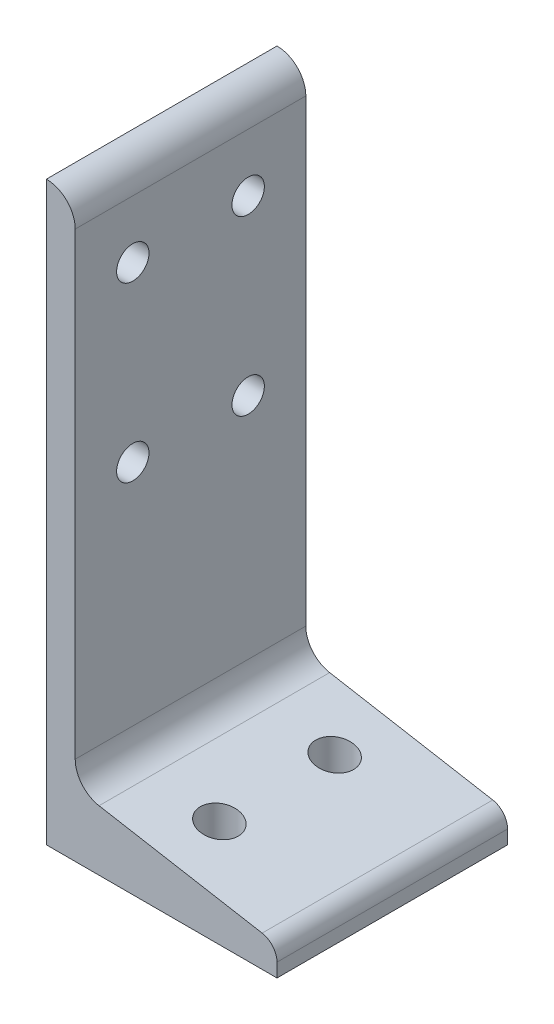
ISO-10303-21;
HEADER;
FILE_DESCRIPTION(('STEP AP214'),'2;1');
FILE_NAME('part.step','',(''),(''),'','','');
FILE_SCHEMA(('AUTOMOTIVE_DESIGN { 1 0 10303 214 1 1 1 1 }'));
ENDSEC;
DATA;
#1=APPLICATION_CONTEXT('core data for automotive mechanical design processes');
#2=APPLICATION_PROTOCOL_DEFINITION('international standard','automotive_design',2000,#1);
#3=PRODUCT_CONTEXT('',#1,'mechanical');
#4=PRODUCT('Part','Part','',(#3));
#5=PRODUCT_RELATED_PRODUCT_CATEGORY('part','',(#4));
#6=PRODUCT_DEFINITION_FORMATION('','',#4);
#7=PRODUCT_DEFINITION_CONTEXT('part definition',#1,'design');
#8=PRODUCT_DEFINITION('design','',#6,#7);
#9=PRODUCT_DEFINITION_SHAPE('','',#8);
#10=(LENGTH_UNIT() NAMED_UNIT(*) SI_UNIT(.MILLI.,.METRE.));
#11=(NAMED_UNIT(*) PLANE_ANGLE_UNIT() SI_UNIT($,.RADIAN.));
#12=(NAMED_UNIT(*) SI_UNIT($,.STERADIAN.) SOLID_ANGLE_UNIT());
#13=UNCERTAINTY_MEASURE_WITH_UNIT(LENGTH_MEASURE(1.E-05),#10,'distance_accuracy_value','');
#14=(GEOMETRIC_REPRESENTATION_CONTEXT(3) GLOBAL_UNCERTAINTY_ASSIGNED_CONTEXT((#13)) GLOBAL_UNIT_ASSIGNED_CONTEXT((#10,
#11,#12)) REPRESENTATION_CONTEXT('',''));
#15=CARTESIAN_POINT('',(0.,0.,0.));
#16=DIRECTION('',(0.,0.,1.));
#17=DIRECTION('',(1.,0.,0.));
#18=AXIS2_PLACEMENT_3D('',#15,#16,#17);
#19=CARTESIAN_POINT('',(-16.3878975119817,-59.0727168406568,-50.8));
#20=DIRECTION('',(-1.,0.,0.));
#21=DIRECTION('',(0.,-1.,0.));
#22=AXIS2_PLACEMENT_3D('',#19,#20,#21);
#23=PLANE('',#22);
#24=CARTESIAN_POINT('',(-16.3878975119818,121.648995440178,-12.6852380775335));
#25=DIRECTION('',(-1.,0.,0.));
#26=DIRECTION('',(0.,1.,0.));
#27=AXIS2_PLACEMENT_3D('',#24,#25,#26);
#28=CIRCLE('',#27,3.56870000000001);
#29=CARTESIAN_POINT('',(-16.3878975119818,125.217695440178,-12.6852380775335));
#30=VERTEX_POINT('',#29);
#31=EDGE_CURVE('E177',#30,#30,#28,.T.);
#32=ORIENTED_EDGE('',*,*,#31,.T.);
#33=EDGE_LOOP('',(#32));
#34=FACE_BOUND('',#33,.T.);
#35=CARTESIAN_POINT('',(-16.3878975119817,83.5489782815445,-12.6852380775335));
#36=DIRECTION('',(-1.,0.,0.));
#37=DIRECTION('',(0.,1.,0.));
#38=AXIS2_PLACEMENT_3D('',#35,#36,#37);
#39=CIRCLE('',#38,3.56869999999999);
#40=CARTESIAN_POINT('',(-16.3878975119817,87.1176782815445,-12.6852380775335));
#41=VERTEX_POINT('',#40);
#42=EDGE_CURVE('E193',#41,#41,#39,.T.);
#43=ORIENTED_EDGE('',*,*,#42,.T.);
#44=EDGE_LOOP('',(#43));
#45=FACE_BOUND('',#44,.T.);
#46=CARTESIAN_POINT('',(-16.3878975119817,83.5489782815445,-38.1));
#47=DIRECTION('',(-1.,0.,0.));
#48=DIRECTION('',(0.,1.,0.));
#49=AXIS2_PLACEMENT_3D('',#46,#47,#48);
#50=CIRCLE('',#49,3.56869999999999);
#51=CARTESIAN_POINT('',(-16.3878975119817,87.1176782815445,-38.1));
#52=VERTEX_POINT('',#51);
#53=EDGE_CURVE('E198',#52,#52,#50,.T.);
#54=ORIENTED_EDGE('',*,*,#53,.T.);
#55=EDGE_LOOP('',(#54));
#56=FACE_BOUND('',#55,.T.);
#57=CARTESIAN_POINT('',(-16.3878975119818,121.648978281545,-38.1));
#58=DIRECTION('',(-1.,0.,0.));
#59=DIRECTION('',(0.,1.,0.));
#60=AXIS2_PLACEMENT_3D('',#57,#58,#59);
#61=CIRCLE('',#60,3.56870000000002);
#62=CARTESIAN_POINT('',(-16.3878975119818,125.217678281545,-38.1));
#63=VERTEX_POINT('',#62);
#64=EDGE_CURVE('E204',#63,#63,#61,.T.);
#65=ORIENTED_EDGE('',*,*,#64,.T.);
#66=EDGE_LOOP('',(#65));
#67=FACE_BOUND('',#66,.T.);
#68=DIRECTION('',(0.,1.,0.));
#69=VECTOR('',#68,1.);
#70=CARTESIAN_POINT('',(-16.3878975119817,-59.0727168406568,0.));
#71=LINE('',#70,#69);
#72=CARTESIAN_POINT('',(-16.3878975119817,33.2149952320115,0.));
#73=VERTEX_POINT('',#72);
#74=CARTESIAN_POINT('',(-16.3878975119818,134.348978281545,0.));
#75=VERTEX_POINT('',#74);
#76=EDGE_CURVE('E209',#73,#75,#71,.T.);
#77=ORIENTED_EDGE('',*,*,#76,.F.);
#78=DIRECTION('',(0.,0.,1.));
#79=VECTOR('',#78,1.);
#80=CARTESIAN_POINT('',(-16.3878975119817,33.2149952320115,-50.8));
#81=LINE('',#80,#79);
#82=CARTESIAN_POINT('',(-16.3878975119817,33.2149952320115,-50.8));
#83=VERTEX_POINT('',#82);
#84=EDGE_CURVE('E276',#83,#73,#81,.T.);
#85=ORIENTED_EDGE('',*,*,#84,.F.);
#86=DIRECTION('',(0.,1.,0.));
#87=VECTOR('',#86,1.);
#88=CARTESIAN_POINT('',(-16.3878975119817,-59.0727168406568,-50.8));
#89=LINE('',#88,#87);
#90=CARTESIAN_POINT('',(-16.3878975119818,134.348978281545,-50.8));
#91=VERTEX_POINT('',#90);
#92=EDGE_CURVE('E155',#83,#91,#89,.T.);
#93=ORIENTED_EDGE('',*,*,#92,.T.);
#94=DIRECTION('',(0.,0.,1.));
#95=VECTOR('',#94,1.);
#96=CARTESIAN_POINT('',(-16.3878975119818,134.348978281545,-50.8));
#97=LINE('',#96,#95);
#98=EDGE_CURVE('E11',#91,#75,#97,.T.);
#99=ORIENTED_EDGE('',*,*,#98,.T.);
#100=EDGE_LOOP('',(#77,#85,#93,#99));
#101=FACE_BOUND('',#100,.T.);
#102=ADVANCED_FACE('F34',(#34,#45,#56,#67,#101),#23,.F.);
#103=CARTESIAN_POINT('',(-22.7378975119818,134.348978281545,-50.8));
#104=DIRECTION('',(0.,0.,1.));
#105=DIRECTION('',(-1.,0.,0.));
#106=AXIS2_PLACEMENT_3D('',#103,#104,#105);
#107=ELLIPSE('',#106,6.35,6.34999999999999);
#108=DIRECTION('',(0.,0.,1.));
#109=VECTOR('',#108,1.);
#110=SURFACE_OF_LINEAR_EXTRUSION('',#107,#109);
#111=CARTESIAN_POINT('',(-22.7378975119818,134.348978281545,0.));
#112=DIRECTION('',(0.,0.,1.));
#113=DIRECTION('',(-1.,0.,0.));
#114=AXIS2_PLACEMENT_3D('',#111,#112,#113);
#115=ELLIPSE('',#114,6.35,6.34999999999999);
#116=CARTESIAN_POINT('',(-22.7378975119817,140.698978281545,0.));
#117=VERTEX_POINT('',#116);
#118=EDGE_CURVE('E278',#75,#117,#115,.T.);
#119=ORIENTED_EDGE('',*,*,#118,.F.);
#120=ORIENTED_EDGE('',*,*,#98,.F.);
#121=CARTESIAN_POINT('',(-22.7378975119817,140.698978281545,-50.8));
#122=VERTEX_POINT('',#121);
#123=EDGE_CURVE('E90',#91,#122,#107,.T.);
#124=ORIENTED_EDGE('',*,*,#123,.T.);
#125=DIRECTION('',(0.,0.,1.));
#126=VECTOR('',#125,1.);
#127=CARTESIAN_POINT('',(-22.7378975119817,140.698978281545,-50.8));
#128=LINE('',#127,#126);
#129=EDGE_CURVE('E43',#122,#117,#128,.T.);
#130=ORIENTED_EDGE('',*,*,#129,.T.);
#131=EDGE_LOOP('',(#119,#120,#124,#130));
#132=FACE_BOUND('',#131,.T.);
#133=ADVANCED_FACE('F146',(#132),#110,.T.);
#134=CARTESIAN_POINT('',(-22.7378975119817,-59.0727168406568,-50.8));
#135=DIRECTION('',(1.,0.,0.));
#136=DIRECTION('',(0.,1.,0.));
#137=AXIS2_PLACEMENT_3D('',#134,#135,#136);
#138=PLANE('',#137);
#139=CARTESIAN_POINT('',(-22.7378975119818,121.648995440178,-12.6852380775335));
#140=DIRECTION('',(-1.,0.,0.));
#141=DIRECTION('',(0.,1.,0.));
#142=AXIS2_PLACEMENT_3D('',#139,#140,#141);
#143=CIRCLE('',#142,3.56870000000001);
#144=CARTESIAN_POINT('',(-22.7378975119818,125.217695440178,-12.6852380775335));
#145=VERTEX_POINT('',#144);
#146=EDGE_CURVE('E182',#145,#145,#143,.T.);
#147=ORIENTED_EDGE('',*,*,#146,.F.);
#148=EDGE_LOOP('',(#147));
#149=FACE_BOUND('',#148,.T.);
#150=CARTESIAN_POINT('',(-22.7378975119818,83.5489782815445,-12.6852380775335));
#151=DIRECTION('',(-1.,0.,0.));
#152=DIRECTION('',(0.,1.,0.));
#153=AXIS2_PLACEMENT_3D('',#150,#151,#152);
#154=CIRCLE('',#153,3.56869999999999);
#155=CARTESIAN_POINT('',(-22.7378975119818,87.1176782815445,-12.6852380775335));
#156=VERTEX_POINT('',#155);
#157=EDGE_CURVE('E195',#156,#156,#154,.T.);
#158=ORIENTED_EDGE('',*,*,#157,.F.);
#159=EDGE_LOOP('',(#158));
#160=FACE_BOUND('',#159,.T.);
#161=CARTESIAN_POINT('',(-22.7378975119818,83.5489782815445,-38.1));
#162=DIRECTION('',(-1.,0.,0.));
#163=DIRECTION('',(0.,1.,0.));
#164=AXIS2_PLACEMENT_3D('',#161,#162,#163);
#165=CIRCLE('',#164,3.56869999999999);
#166=CARTESIAN_POINT('',(-22.7378975119818,87.1176782815445,-38.1));
#167=VERTEX_POINT('',#166);
#168=EDGE_CURVE('E201',#167,#167,#165,.T.);
#169=ORIENTED_EDGE('',*,*,#168,.F.);
#170=EDGE_LOOP('',(#169));
#171=FACE_BOUND('',#170,.T.);
#172=CARTESIAN_POINT('',(-22.7378975119818,121.648978281545,-38.1));
#173=DIRECTION('',(-1.,0.,0.));
#174=DIRECTION('',(0.,1.,0.));
#175=AXIS2_PLACEMENT_3D('',#172,#173,#174);
#176=CIRCLE('',#175,3.56870000000002);
#177=CARTESIAN_POINT('',(-22.7378975119818,125.217678281545,-38.1));
#178=VERTEX_POINT('',#177);
#179=EDGE_CURVE('E207',#178,#178,#176,.T.);
#180=ORIENTED_EDGE('',*,*,#179,.F.);
#181=EDGE_LOOP('',(#180));
#182=FACE_BOUND('',#181,.T.);
#183=DIRECTION('',(0.,-1.,0.));
#184=VECTOR('',#183,1.);
#185=CARTESIAN_POINT('',(-22.7378975119817,-59.0727168406568,0.));
#186=LINE('',#185,#184);
#187=CARTESIAN_POINT('',(-22.7378975119817,13.6989782815445,0.));
#188=VERTEX_POINT('',#187);
#189=EDGE_CURVE('E281',#117,#188,#186,.T.);
#190=ORIENTED_EDGE('',*,*,#189,.F.);
#191=ORIENTED_EDGE('',*,*,#129,.F.);
#192=DIRECTION('',(0.,-1.,0.));
#193=VECTOR('',#192,1.);
#194=CARTESIAN_POINT('',(-22.7378975119817,-59.0727168406568,-50.8));
#195=LINE('',#194,#193);
#196=CARTESIAN_POINT('',(-22.7378975119817,13.6989782815445,-50.8));
#197=VERTEX_POINT('',#196);
#198=EDGE_CURVE('E154',#122,#197,#195,.T.);
#199=ORIENTED_EDGE('',*,*,#198,.T.);
#200=DIRECTION('',(0.,0.,1.));
#201=VECTOR('',#200,1.);
#202=CARTESIAN_POINT('',(-22.7378975119817,13.6989782815445,-50.8));
#203=LINE('',#202,#201);
#204=EDGE_CURVE('E166',#197,#188,#203,.T.);
#205=ORIENTED_EDGE('',*,*,#204,.T.);
#206=EDGE_LOOP('',(#190,#191,#199,#205));
#207=FACE_BOUND('',#206,.T.);
#208=ADVANCED_FACE('F143',(#149,#160,#171,#182,#207),#138,.F.);
#209=CARTESIAN_POINT('',(-12.9149361595296,13.6989782815445,-50.8));
#210=DIRECTION('',(0.,1.,0.));
#211=DIRECTION('',(-1.,0.,0.));
#212=AXIS2_PLACEMENT_3D('',#209,#210,#211);
#213=PLANE('',#212);
#214=CARTESIAN_POINT('',(2.66210248801829,13.6989782815445,-38.1));
#215=DIRECTION('',(0.,1.,0.));
#216=DIRECTION('',(1.,0.,0.));
#217=AXIS2_PLACEMENT_3D('',#214,#215,#216);
#218=CIRCLE('',#217,4.1656);
#219=CARTESIAN_POINT('',(6.82770248801829,13.6989782815445,-38.1));
#220=VERTEX_POINT('',#219);
#221=EDGE_CURVE('E189',#220,#220,#218,.T.);
#222=ORIENTED_EDGE('',*,*,#221,.T.);
#223=EDGE_LOOP('',(#222));
#224=FACE_BOUND('',#223,.T.);
#225=CARTESIAN_POINT('',(2.66210248801829,13.6989782815445,-12.7));
#226=DIRECTION('',(0.,1.,0.));
#227=DIRECTION('',(1.,0.,0.));
#228=AXIS2_PLACEMENT_3D('',#225,#226,#227);
#229=CIRCLE('',#228,4.1656);
#230=CARTESIAN_POINT('',(6.82770248801829,13.6989782815445,-12.7));
#231=VERTEX_POINT('',#230);
#232=EDGE_CURVE('E178',#231,#231,#229,.T.);
#233=ORIENTED_EDGE('',*,*,#232,.T.);
#234=EDGE_LOOP('',(#233));
#235=FACE_BOUND('',#234,.T.);
#236=DIRECTION('',(1.,0.,0.));
#237=VECTOR('',#236,1.);
#238=CARTESIAN_POINT('',(-12.9149361595296,13.6989782815445,0.));
#239=LINE('',#238,#237);
#240=CARTESIAN_POINT('',(28.0621024880183,13.6989782815445,0.));
#241=VERTEX_POINT('',#240);
#242=EDGE_CURVE('E284',#188,#241,#239,.T.);
#243=ORIENTED_EDGE('',*,*,#242,.F.);
#244=ORIENTED_EDGE('',*,*,#204,.F.);
#245=DIRECTION('',(1.,0.,0.));
#246=VECTOR('',#245,1.);
#247=CARTESIAN_POINT('',(-12.9149361595296,13.6989782815445,-50.8));
#248=LINE('',#247,#246);
#249=CARTESIAN_POINT('',(28.0621024880183,13.6989782815445,-50.8));
#250=VERTEX_POINT('',#249);
#251=EDGE_CURVE('E126',#197,#250,#248,.T.);
#252=ORIENTED_EDGE('',*,*,#251,.T.);
#253=DIRECTION('',(0.,0.,1.));
#254=VECTOR('',#253,1.);
#255=CARTESIAN_POINT('',(28.0621024880183,13.6989782815445,-50.8));
#256=LINE('',#255,#254);
#257=EDGE_CURVE('E163',#250,#241,#256,.T.);
#258=ORIENTED_EDGE('',*,*,#257,.T.);
#259=EDGE_LOOP('',(#243,#244,#252,#258));
#260=FACE_BOUND('',#259,.T.);
#261=ADVANCED_FACE('F139',(#224,#235,#260),#213,.F.);
#262=CARTESIAN_POINT('',(28.0621024880184,-59.0727168406568,-50.8));
#263=DIRECTION('',(-1.,0.,0.));
#264=DIRECTION('',(0.,-1.,0.));
#265=AXIS2_PLACEMENT_3D('',#262,#263,#264);
#266=PLANE('',#265);
#267=DIRECTION('',(0.,1.,0.));
#268=VECTOR('',#267,1.);
#269=CARTESIAN_POINT('',(28.0621024880184,-59.0727168406568,0.));
#270=LINE('',#269,#268);
#271=CARTESIAN_POINT('',(28.0621024880183,16.7241299029677,0.));
#272=VERTEX_POINT('',#271);
#273=EDGE_CURVE('E169',#241,#272,#270,.T.);
#274=ORIENTED_EDGE('',*,*,#273,.F.);
#275=ORIENTED_EDGE('',*,*,#257,.F.);
#276=DIRECTION('',(0.,1.,0.));
#277=VECTOR('',#276,1.);
#278=CARTESIAN_POINT('',(28.0621024880184,-59.0727168406568,-50.8));
#279=LINE('',#278,#277);
#280=CARTESIAN_POINT('',(28.0621024880183,16.7241299029677,-50.8));
#281=VERTEX_POINT('',#280);
#282=EDGE_CURVE('E124',#250,#281,#279,.T.);
#283=ORIENTED_EDGE('',*,*,#282,.T.);
#284=DIRECTION('',(0.,0.,1.));
#285=VECTOR('',#284,1.);
#286=CARTESIAN_POINT('',(28.0621024880183,16.7241299029677,-50.8));
#287=LINE('',#286,#285);
#288=EDGE_CURVE('E118',#281,#272,#287,.T.);
#289=ORIENTED_EDGE('',*,*,#288,.T.);
#290=EDGE_LOOP('',(#274,#275,#283,#289));
#291=FACE_BOUND('',#290,.T.);
#292=ADVANCED_FACE('F135',(#291),#266,.F.);
#293=CARTESIAN_POINT('',(24.0997024880183,16.7241299029677,-50.8));
#294=DIRECTION('',(0.,0.,1.));
#295=DIRECTION('',(1.,0.,0.));
#296=AXIS2_PLACEMENT_3D('',#293,#294,#295);
#297=ELLIPSE('',#296,3.9624,3.9624);
#298=DIRECTION('',(0.,0.,1.));
#299=VECTOR('',#298,1.);
#300=SURFACE_OF_LINEAR_EXTRUSION('',#297,#299);
#301=CARTESIAN_POINT('',(24.0997024880183,16.7241299029677,0.));
#302=DIRECTION('',(0.,0.,1.));
#303=DIRECTION('',(1.,0.,0.));
#304=AXIS2_PLACEMENT_3D('',#301,#302,#303);
#305=ELLIPSE('',#304,3.9624,3.9624);
#306=CARTESIAN_POINT('',(24.7877660272057,20.6263321435033,0.));
#307=VERTEX_POINT('',#306);
#308=EDGE_CURVE('E287',#272,#307,#305,.T.);
#309=ORIENTED_EDGE('',*,*,#308,.F.);
#310=ORIENTED_EDGE('',*,*,#288,.F.);
#311=CARTESIAN_POINT('',(24.7877660272057,20.6263321435033,-50.8));
#312=VERTEX_POINT('',#311);
#313=EDGE_CURVE('E108',#281,#312,#297,.T.);
#314=ORIENTED_EDGE('',*,*,#313,.T.);
#315=DIRECTION('',(0.,0.,1.));
#316=VECTOR('',#315,1.);
#317=CARTESIAN_POINT('',(24.7877660272057,20.6263321435033,-50.8));
#318=LINE('',#317,#316);
#319=EDGE_CURVE('E113',#312,#307,#318,.T.);
#320=ORIENTED_EDGE('',*,*,#319,.T.);
#321=EDGE_LOOP('',(#309,#310,#314,#320));
#322=FACE_BOUND('',#321,.T.);
#323=ADVANCED_FACE('F121',(#322),#300,.T.);
#324=CARTESIAN_POINT('',(1.85127949779703,24.6706535612943,-50.8));
#325=DIRECTION('',(-0.17364817766693,-0.984807753012208,0.));
#326=DIRECTION('',(0.984807753012208,-0.17364817766693,0.));
#327=AXIS2_PLACEMENT_3D('',#324,#325,#326);
#328=PLANE('',#327);
#329=CARTESIAN_POINT('',(2.66210248801829,24.5276835915395,-38.1));
#330=DIRECTION('',(0.17364817766693,0.984807753012208,0.));
#331=DIRECTION('',(0.984807753012208,-0.17364817766693,0.));
#332=AXIS2_PLACEMENT_3D('',#329,#330,#331);
#333=ELLIPSE('',#332,4.22986109447126,4.1656);
#334=CARTESIAN_POINT('',(6.82770248801829,23.7931759207004,-38.1));
#335=VERTEX_POINT('',#334);
#336=EDGE_CURVE('E37',#335,#335,#333,.T.);
#337=ORIENTED_EDGE('',*,*,#336,.F.);
#338=EDGE_LOOP('',(#337));
#339=FACE_BOUND('',#338,.T.);
#340=CARTESIAN_POINT('',(2.66210248801829,24.5276835915395,-12.7));
#341=DIRECTION('',(0.17364817766693,0.984807753012208,0.));
#342=DIRECTION('',(0.984807753012208,-0.17364817766693,0.));
#343=AXIS2_PLACEMENT_3D('',#340,#341,#342);
#344=ELLIPSE('',#343,4.22986109447126,4.1656);
#345=CARTESIAN_POINT('',(6.82770248801829,23.7931759207004,-12.7));
#346=VERTEX_POINT('',#345);
#347=EDGE_CURVE('E175',#346,#346,#344,.T.);
#348=ORIENTED_EDGE('',*,*,#347,.F.);
#349=EDGE_LOOP('',(#348));
#350=FACE_BOUND('',#349,.T.);
#351=DIRECTION('',(-0.984807753012208,0.17364817766693,0.));
#352=VECTOR('',#351,1.);
#353=CARTESIAN_POINT('',(1.85127949779703,24.6706535612943,0.));
#354=LINE('',#353,#352);
#355=CARTESIAN_POINT('',(-11.1405634401667,26.961466000384,0.));
#356=VERTEX_POINT('',#355);
#357=EDGE_CURVE('E115',#307,#356,#354,.T.);
#358=ORIENTED_EDGE('',*,*,#357,.F.);
#359=ORIENTED_EDGE('',*,*,#319,.F.);
#360=DIRECTION('',(-0.984807753012208,0.17364817766693,0.));
#361=VECTOR('',#360,1.);
#362=CARTESIAN_POINT('',(1.85127949779703,24.6706535612943,-50.8));
#363=LINE('',#362,#361);
#364=CARTESIAN_POINT('',(-11.1405634401667,26.961466000384,-50.8));
#365=VERTEX_POINT('',#364);
#366=EDGE_CURVE('E104',#312,#365,#363,.T.);
#367=ORIENTED_EDGE('',*,*,#366,.T.);
#368=DIRECTION('',(0.,0.,1.));
#369=VECTOR('',#368,1.);
#370=CARTESIAN_POINT('',(-11.1405634401667,26.961466000384,-50.8));
#371=LINE('',#370,#369);
#372=EDGE_CURVE('E119',#365,#356,#371,.T.);
#373=ORIENTED_EDGE('',*,*,#372,.T.);
#374=EDGE_LOOP('',(#358,#359,#367,#373));
#375=FACE_BOUND('',#374,.T.);
#376=ADVANCED_FACE('F114',(#339,#350,#375),#328,.F.);
#377=CARTESIAN_POINT('',(-10.0378975119817,33.2149952320115,-50.8));
#378=DIRECTION('',(0.,0.,1.));
#379=DIRECTION('',(0.,1.,0.));
#380=AXIS2_PLACEMENT_3D('',#377,#378,#379);
#381=ELLIPSE('',#380,6.35,6.35);
#382=DIRECTION('',(0.,0.,1.));
#383=VECTOR('',#382,1.);
#384=SURFACE_OF_LINEAR_EXTRUSION('',#381,#383);
#385=CARTESIAN_POINT('',(-10.0378975119817,33.2149952320115,0.));
#386=DIRECTION('',(0.,0.,1.));
#387=DIRECTION('',(0.,1.,0.));
#388=AXIS2_PLACEMENT_3D('',#385,#386,#387);
#389=ELLIPSE('',#388,6.35,6.35);
#390=EDGE_CURVE('E78',#73,#356,#389,.T.);
#391=ORIENTED_EDGE('',*,*,#390,.T.);
#392=ORIENTED_EDGE('',*,*,#372,.F.);
#393=EDGE_CURVE('E52',#83,#365,#381,.T.);
#394=ORIENTED_EDGE('',*,*,#393,.F.);
#395=ORIENTED_EDGE('',*,*,#84,.T.);
#396=EDGE_LOOP('',(#391,#392,#394,#395));
#397=FACE_BOUND('',#396,.T.);
#398=ADVANCED_FACE('F267',(#397),#384,.F.);
#399=CARTESIAN_POINT('',(-12.9149361595296,-59.0727168406568,-50.8));
#400=DIRECTION('',(0.,0.,-1.));
#401=DIRECTION('',(1.,0.,0.));
#402=AXIS2_PLACEMENT_3D('',#399,#400,#401);
#403=PLANE('',#402);
#404=ORIENTED_EDGE('',*,*,#92,.F.);
#405=ORIENTED_EDGE('',*,*,#393,.T.);
#406=ORIENTED_EDGE('',*,*,#366,.F.);
#407=ORIENTED_EDGE('',*,*,#313,.F.);
#408=ORIENTED_EDGE('',*,*,#282,.F.);
#409=ORIENTED_EDGE('',*,*,#251,.F.);
#410=ORIENTED_EDGE('',*,*,#198,.F.);
#411=ORIENTED_EDGE('',*,*,#123,.F.);
#412=EDGE_LOOP('',(#404,#405,#406,#407,#408,#409,#410,#411));
#413=FACE_BOUND('',#412,.T.);
#414=ADVANCED_FACE('F106',(#413),#403,.T.);
#415=CARTESIAN_POINT('',(-12.9149361595296,-59.0727168406568,0.));
#416=DIRECTION('',(0.,0.,-1.));
#417=DIRECTION('',(1.,0.,0.));
#418=AXIS2_PLACEMENT_3D('',#415,#416,#417);
#419=PLANE('',#418);
#420=ORIENTED_EDGE('',*,*,#76,.T.);
#421=ORIENTED_EDGE('',*,*,#118,.T.);
#422=ORIENTED_EDGE('',*,*,#189,.T.);
#423=ORIENTED_EDGE('',*,*,#242,.T.);
#424=ORIENTED_EDGE('',*,*,#273,.T.);
#425=ORIENTED_EDGE('',*,*,#308,.T.);
#426=ORIENTED_EDGE('',*,*,#357,.T.);
#427=ORIENTED_EDGE('',*,*,#390,.F.);
#428=EDGE_LOOP('',(#420,#421,#422,#423,#424,#425,#426,#427));
#429=FACE_BOUND('',#428,.T.);
#430=ADVANCED_FACE('F218',(#429),#419,.F.);
#431=CARTESIAN_POINT('',(-22.7378975119818,121.648978281545,-38.1));
#432=DIRECTION('',(1.,0.,0.));
#433=DIRECTION('',(0.,1.,0.));
#434=AXIS2_PLACEMENT_3D('',#431,#432,#433);
#435=CYLINDRICAL_SURFACE('',#434,3.56870000000002);
#436=ORIENTED_EDGE('',*,*,#179,.T.);
#437=EDGE_LOOP('',(#436));
#438=FACE_BOUND('',#437,.T.);
#439=ORIENTED_EDGE('',*,*,#64,.F.);
#440=EDGE_LOOP('',(#439));
#441=FACE_BOUND('',#440,.T.);
#442=ADVANCED_FACE('F215',(#438,#441),#435,.F.);
#443=CARTESIAN_POINT('',(-22.7378975119818,83.5489782815445,-38.1));
#444=DIRECTION('',(1.,0.,0.));
#445=DIRECTION('',(0.,1.,0.));
#446=AXIS2_PLACEMENT_3D('',#443,#444,#445);
#447=CYLINDRICAL_SURFACE('',#446,3.56869999999999);
#448=ORIENTED_EDGE('',*,*,#168,.T.);
#449=EDGE_LOOP('',(#448));
#450=FACE_BOUND('',#449,.T.);
#451=ORIENTED_EDGE('',*,*,#53,.F.);
#452=EDGE_LOOP('',(#451));
#453=FACE_BOUND('',#452,.T.);
#454=ADVANCED_FACE('F217',(#450,#453),#447,.F.);
#455=CARTESIAN_POINT('',(-22.7378975119818,83.5489782815445,-12.6852380775335));
#456=DIRECTION('',(1.,0.,0.));
#457=DIRECTION('',(0.,1.,0.));
#458=AXIS2_PLACEMENT_3D('',#455,#456,#457);
#459=CYLINDRICAL_SURFACE('',#458,3.56869999999999);
#460=ORIENTED_EDGE('',*,*,#157,.T.);
#461=EDGE_LOOP('',(#460));
#462=FACE_BOUND('',#461,.T.);
#463=ORIENTED_EDGE('',*,*,#42,.F.);
#464=EDGE_LOOP('',(#463));
#465=FACE_BOUND('',#464,.T.);
#466=ADVANCED_FACE('F225',(#462,#465),#459,.F.);
#467=CARTESIAN_POINT('',(-22.7378975119818,121.648995440178,-12.6852380775335));
#468=DIRECTION('',(1.,0.,0.));
#469=DIRECTION('',(0.,1.,0.));
#470=AXIS2_PLACEMENT_3D('',#467,#468,#469);
#471=CYLINDRICAL_SURFACE('',#470,3.56870000000001);
#472=ORIENTED_EDGE('',*,*,#146,.T.);
#473=EDGE_LOOP('',(#472));
#474=FACE_BOUND('',#473,.T.);
#475=ORIENTED_EDGE('',*,*,#31,.F.);
#476=EDGE_LOOP('',(#475));
#477=FACE_BOUND('',#476,.T.);
#478=ADVANCED_FACE('F242',(#474,#477),#471,.F.);
#479=CARTESIAN_POINT('',(2.66210248801824,140.698978281545,-12.7));
#480=DIRECTION('',(0.,-1.,0.));
#481=DIRECTION('',(1.,0.,0.));
#482=AXIS2_PLACEMENT_3D('',#479,#480,#481);
#483=CYLINDRICAL_SURFACE('',#482,4.1656);
#484=ORIENTED_EDGE('',*,*,#232,.F.);
#485=EDGE_LOOP('',(#484));
#486=FACE_BOUND('',#485,.T.);
#487=ORIENTED_EDGE('',*,*,#347,.T.);
#488=EDGE_LOOP('',(#487));
#489=FACE_BOUND('',#488,.T.);
#490=ADVANCED_FACE('F248',(#486,#489),#483,.F.);
#491=CARTESIAN_POINT('',(2.66210248801824,140.698978281545,-38.1));
#492=DIRECTION('',(0.,-1.,0.));
#493=DIRECTION('',(1.,0.,0.));
#494=AXIS2_PLACEMENT_3D('',#491,#492,#493);
#495=CYLINDRICAL_SURFACE('',#494,4.1656);
#496=ORIENTED_EDGE('',*,*,#221,.F.);
#497=EDGE_LOOP('',(#496));
#498=FACE_BOUND('',#497,.T.);
#499=ORIENTED_EDGE('',*,*,#336,.T.);
#500=EDGE_LOOP('',(#499));
#501=FACE_BOUND('',#500,.T.);
#502=ADVANCED_FACE('F254',(#498,#501),#495,.F.);
#503=CLOSED_SHELL('',(#102,#133,#208,#261,#292,#323,#376,#398,#414,#430,#442,#454,#466,#478,
#490,#502));
#504=MANIFOLD_SOLID_BREP('B2',#503);
#505=ADVANCED_BREP_SHAPE_REPRESENTATION('',(#18,#504),#14);
#506=SHAPE_DEFINITION_REPRESENTATION(#9,#505);
ENDSEC;
END-ISO-10303-21;
